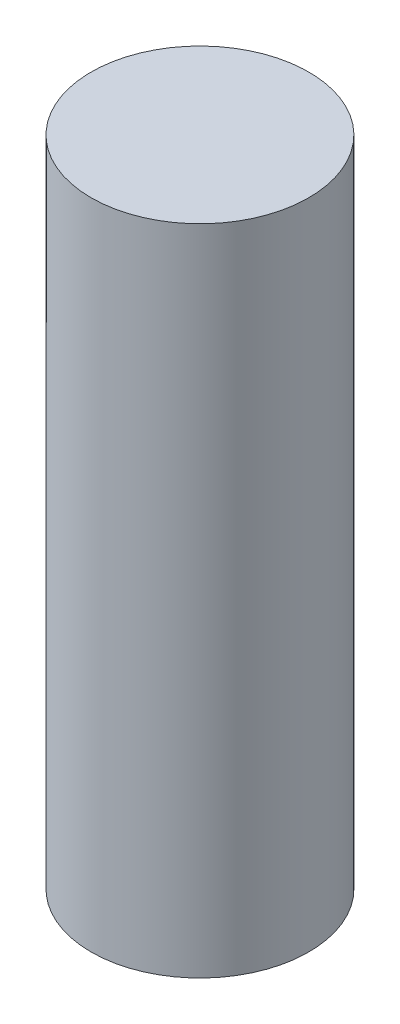
ISO-10303-21;
HEADER;
FILE_DESCRIPTION(('STEP AP214'),'2;1');
FILE_NAME('part.step','',(''),(''),'','','');
FILE_SCHEMA(('AUTOMOTIVE_DESIGN { 1 0 10303 214 1 1 1 1 }'));
ENDSEC;
DATA;
#1=APPLICATION_CONTEXT('core data for automotive mechanical design processes');
#2=APPLICATION_PROTOCOL_DEFINITION('international standard','automotive_design',2000,#1);
#3=PRODUCT_CONTEXT('',#1,'mechanical');
#4=PRODUCT('Part','Part','',(#3));
#5=PRODUCT_RELATED_PRODUCT_CATEGORY('part','',(#4));
#6=PRODUCT_DEFINITION_FORMATION('','',#4);
#7=PRODUCT_DEFINITION_CONTEXT('part definition',#1,'design');
#8=PRODUCT_DEFINITION('design','',#6,#7);
#9=PRODUCT_DEFINITION_SHAPE('','',#8);
#10=(LENGTH_UNIT() NAMED_UNIT(*) SI_UNIT(.MILLI.,.METRE.));
#11=(NAMED_UNIT(*) PLANE_ANGLE_UNIT() SI_UNIT($,.RADIAN.));
#12=(NAMED_UNIT(*) SI_UNIT($,.STERADIAN.) SOLID_ANGLE_UNIT());
#13=UNCERTAINTY_MEASURE_WITH_UNIT(LENGTH_MEASURE(1.E-05),#10,'distance_accuracy_value','');
#14=(GEOMETRIC_REPRESENTATION_CONTEXT(3) GLOBAL_UNCERTAINTY_ASSIGNED_CONTEXT((#13)) GLOBAL_UNIT_ASSIGNED_CONTEXT((#10,
#11,#12)) REPRESENTATION_CONTEXT('',''));
#15=CARTESIAN_POINT('',(0.,0.,0.));
#16=DIRECTION('',(0.,0.,1.));
#17=DIRECTION('',(1.,0.,0.));
#18=AXIS2_PLACEMENT_3D('',#15,#16,#17);
#19=CARTESIAN_POINT('',(0.,36.,0.));
#20=DIRECTION('',(0.,-1.,0.));
#21=DIRECTION('',(0.,0.,-1.));
#22=AXIS2_PLACEMENT_3D('',#19,#20,#21);
#23=CYLINDRICAL_SURFACE('',#22,6.);
#24=CARTESIAN_POINT('',(0.,36.,0.));
#25=DIRECTION('',(0.,1.,0.));
#26=DIRECTION('',(0.,0.,1.));
#27=AXIS2_PLACEMENT_3D('',#24,#25,#26);
#28=CIRCLE('',#27,6.);
#29=CARTESIAN_POINT('',(0.,36.,6.));
#30=VERTEX_POINT('',#29);
#31=EDGE_CURVE('E10',#30,#30,#28,.T.);
#32=ORIENTED_EDGE('',*,*,#31,.F.);
#33=EDGE_LOOP('',(#32));
#34=FACE_BOUND('',#33,.T.);
#35=CARTESIAN_POINT('',(0.,0.,0.));
#36=DIRECTION('',(0.,1.,0.));
#37=DIRECTION('',(0.,0.,1.));
#38=AXIS2_PLACEMENT_3D('',#35,#36,#37);
#39=CIRCLE('',#38,6.);
#40=CARTESIAN_POINT('',(0.,0.,6.));
#41=VERTEX_POINT('',#40);
#42=EDGE_CURVE('E40',#41,#41,#39,.T.);
#43=ORIENTED_EDGE('',*,*,#42,.T.);
#44=EDGE_LOOP('',(#43));
#45=FACE_BOUND('',#44,.T.);
#46=ADVANCED_FACE('F37',(#34,#45),#23,.T.);
#47=CARTESIAN_POINT('',(0.,36.,0.));
#48=DIRECTION('',(0.,1.,0.));
#49=DIRECTION('',(0.,0.,1.));
#50=AXIS2_PLACEMENT_3D('',#47,#48,#49);
#51=PLANE('',#50);
#52=ORIENTED_EDGE('',*,*,#31,.T.);
#53=EDGE_LOOP('',(#52));
#54=FACE_BOUND('',#53,.T.);
#55=ADVANCED_FACE('F54',(#54),#51,.T.);
#56=CARTESIAN_POINT('',(0.,0.,0.));
#57=DIRECTION('',(0.,1.,0.));
#58=DIRECTION('',(0.,0.,1.));
#59=AXIS2_PLACEMENT_3D('',#56,#57,#58);
#60=PLANE('',#59);
#61=ORIENTED_EDGE('',*,*,#42,.F.);
#62=EDGE_LOOP('',(#61));
#63=FACE_BOUND('',#62,.T.);
#64=ADVANCED_FACE('F52',(#63),#60,.F.);
#65=CLOSED_SHELL('',(#46,#55,#64));
#66=MANIFOLD_SOLID_BREP('B2',#65);
#67=ADVANCED_BREP_SHAPE_REPRESENTATION('',(#18,#66),#14);
#68=SHAPE_DEFINITION_REPRESENTATION(#9,#67);
ENDSEC;
END-ISO-10303-21;
